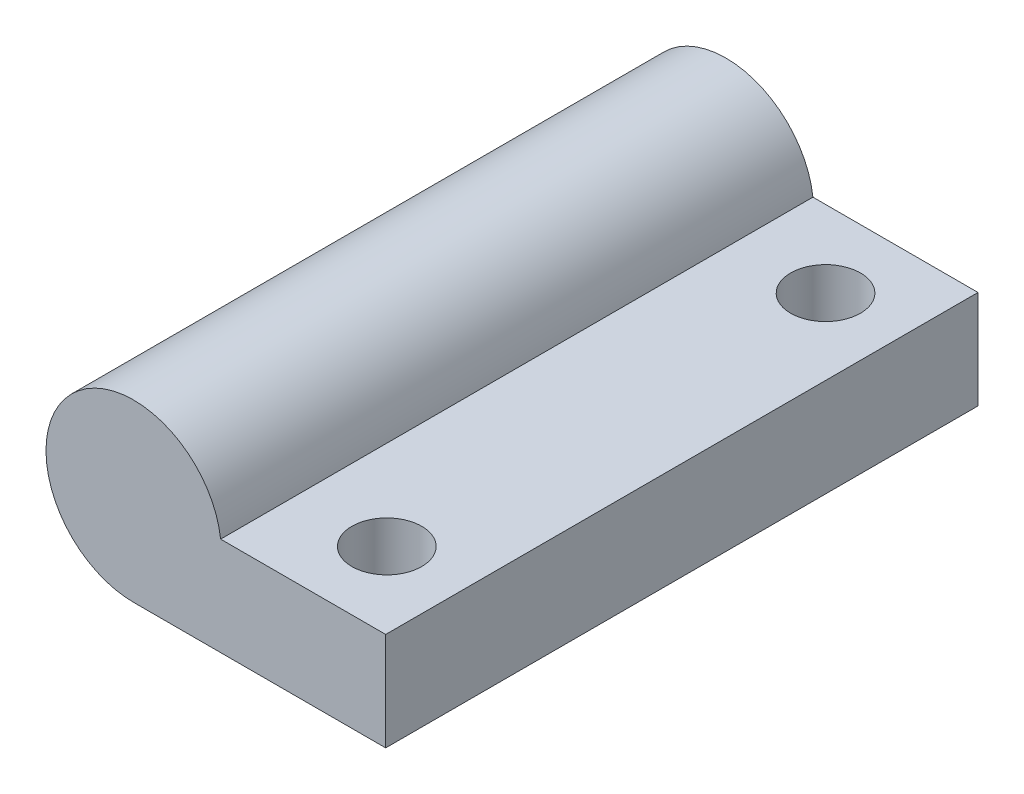
ISO-10303-21;
HEADER;
FILE_DESCRIPTION(('STEP AP214'),'2;1');
FILE_NAME('part.step','',(''),(''),'','','');
FILE_SCHEMA(('AUTOMOTIVE_DESIGN { 1 0 10303 214 1 1 1 1 }'));
ENDSEC;
DATA;
#1=APPLICATION_CONTEXT('core data for automotive mechanical design processes');
#2=APPLICATION_PROTOCOL_DEFINITION('international standard','automotive_design',2000,#1);
#3=PRODUCT_CONTEXT('',#1,'mechanical');
#4=PRODUCT('Part','Part','',(#3));
#5=PRODUCT_RELATED_PRODUCT_CATEGORY('part','',(#4));
#6=PRODUCT_DEFINITION_FORMATION('','',#4);
#7=PRODUCT_DEFINITION_CONTEXT('part definition',#1,'design');
#8=PRODUCT_DEFINITION('design','',#6,#7);
#9=PRODUCT_DEFINITION_SHAPE('','',#8);
#10=(LENGTH_UNIT() NAMED_UNIT(*) SI_UNIT(.MILLI.,.METRE.));
#11=(NAMED_UNIT(*) PLANE_ANGLE_UNIT() SI_UNIT($,.RADIAN.));
#12=(NAMED_UNIT(*) SI_UNIT($,.STERADIAN.) SOLID_ANGLE_UNIT());
#13=UNCERTAINTY_MEASURE_WITH_UNIT(LENGTH_MEASURE(1.E-05),#10,'distance_accuracy_value','');
#14=(GEOMETRIC_REPRESENTATION_CONTEXT(3) GLOBAL_UNCERTAINTY_ASSIGNED_CONTEXT((#13)) GLOBAL_UNIT_ASSIGNED_CONTEXT((#10,
#11,#12)) REPRESENTATION_CONTEXT('',''));
#15=CARTESIAN_POINT('',(0.,0.,0.));
#16=DIRECTION('',(0.,0.,1.));
#17=DIRECTION('',(1.,0.,0.));
#18=AXIS2_PLACEMENT_3D('',#15,#16,#17);
#19=CARTESIAN_POINT('',(-19.1497125132568,32.0635965828504,42.8625));
#20=DIRECTION('',(0.,0.,-1.));
#21=DIRECTION('',(-1.,0.,0.));
#22=AXIS2_PLACEMENT_3D('',#19,#20,#21);
#23=CYLINDRICAL_SURFACE('',#22,6.34209567040549);
#24=CARTESIAN_POINT('',(-19.1497125132568,32.0635965828504,0.));
#25=DIRECTION('',(0.,0.,1.));
#26=DIRECTION('',(1.,0.,0.));
#27=AXIS2_PLACEMENT_3D('',#24,#25,#26);
#28=CIRCLE('',#27,6.34209567040549);
#29=CARTESIAN_POINT('',(-12.8545605618301,32.833816941595,0.));
#30=VERTEX_POINT('',#29);
#31=CARTESIAN_POINT('',(-19.0864000000001,25.721816941595,0.));
#32=VERTEX_POINT('',#31);
#33=EDGE_CURVE('E97',#30,#32,#28,.T.);
#34=ORIENTED_EDGE('',*,*,#33,.T.);
#35=DIRECTION('',(0.,0.,-1.));
#36=VECTOR('',#35,1.);
#37=CARTESIAN_POINT('',(-19.0864000000001,25.721816941595,42.8625));
#38=LINE('',#37,#36);
#39=CARTESIAN_POINT('',(-19.0864000000001,25.721816941595,42.8625));
#40=VERTEX_POINT('',#39);
#41=EDGE_CURVE('E11',#40,#32,#38,.T.);
#42=ORIENTED_EDGE('',*,*,#41,.F.);
#43=CARTESIAN_POINT('',(-19.1497125132568,32.0635965828504,42.8625));
#44=DIRECTION('',(0.,0.,1.));
#45=DIRECTION('',(1.,0.,0.));
#46=AXIS2_PLACEMENT_3D('',#43,#44,#45);
#47=CIRCLE('',#46,6.34209567040549);
#48=CARTESIAN_POINT('',(-12.8545605618301,32.833816941595,42.8625));
#49=VERTEX_POINT('',#48);
#50=EDGE_CURVE('E84',#49,#40,#47,.T.);
#51=ORIENTED_EDGE('',*,*,#50,.F.);
#52=DIRECTION('',(0.,0.,-1.));
#53=VECTOR('',#52,1.);
#54=CARTESIAN_POINT('',(-12.8545605618301,32.833816941595,42.8625));
#55=LINE('',#54,#53);
#56=EDGE_CURVE('E93',#49,#30,#55,.T.);
#57=ORIENTED_EDGE('',*,*,#56,.T.);
#58=EDGE_LOOP('',(#34,#42,#51,#57));
#59=FACE_BOUND('',#58,.T.);
#60=ADVANCED_FACE('F31',(#59),#23,.T.);
#61=CARTESIAN_POINT('',(-19.0864000000001,25.721816941595,42.8625));
#62=DIRECTION('',(0.,1.,0.));
#63=DIRECTION('',(0.,0.,1.));
#64=AXIS2_PLACEMENT_3D('',#61,#62,#63);
#65=PLANE('',#64);
#66=CARTESIAN_POINT('',(-6.38640000000008,25.721816941595,37.30625));
#67=DIRECTION('',(0.,1.,0.));
#68=DIRECTION('',(0.,0.,1.));
#69=AXIS2_PLACEMENT_3D('',#66,#67,#68);
#70=CIRCLE('',#69,1.25911903444891);
#71=CARTESIAN_POINT('',(-6.38640000000008,25.721816941595,38.5653690344489));
#72=VERTEX_POINT('',#71);
#73=EDGE_CURVE('E34',#72,#72,#70,.T.);
#74=ORIENTED_EDGE('',*,*,#73,.T.);
#75=EDGE_LOOP('',(#74));
#76=FACE_BOUND('',#75,.T.);
#77=CARTESIAN_POINT('',(-6.38640000000008,25.721816941595,5.55625));
#78=DIRECTION('',(0.,1.,0.));
#79=DIRECTION('',(0.,0.,1.));
#80=AXIS2_PLACEMENT_3D('',#77,#78,#79);
#81=CIRCLE('',#80,1.25911903444891);
#82=CARTESIAN_POINT('',(-6.38640000000008,25.721816941595,6.81536903444891));
#83=VERTEX_POINT('',#82);
#84=EDGE_CURVE('E100',#83,#83,#81,.T.);
#85=ORIENTED_EDGE('',*,*,#84,.T.);
#86=EDGE_LOOP('',(#85));
#87=FACE_BOUND('',#86,.T.);
#88=DIRECTION('',(1.,0.,0.));
#89=VECTOR('',#88,1.);
#90=CARTESIAN_POINT('',(-19.0864000000001,25.721816941595,0.));
#91=LINE('',#90,#89);
#92=CARTESIAN_POINT('',(-0.91057903979852,25.721816941595,0.));
#93=VERTEX_POINT('',#92);
#94=EDGE_CURVE('E88',#32,#93,#91,.T.);
#95=ORIENTED_EDGE('',*,*,#94,.T.);
#96=DIRECTION('',(0.,0.,-1.));
#97=VECTOR('',#96,1.);
#98=CARTESIAN_POINT('',(-0.91057903979852,25.721816941595,42.8625));
#99=LINE('',#98,#97);
#100=CARTESIAN_POINT('',(-0.91057903979852,25.721816941595,42.8625));
#101=VERTEX_POINT('',#100);
#102=EDGE_CURVE('E40',#101,#93,#99,.T.);
#103=ORIENTED_EDGE('',*,*,#102,.F.);
#104=DIRECTION('',(1.,0.,0.));
#105=VECTOR('',#104,1.);
#106=CARTESIAN_POINT('',(-19.0864000000001,25.721816941595,42.8625));
#107=LINE('',#106,#105);
#108=EDGE_CURVE('E79',#40,#101,#107,.T.);
#109=ORIENTED_EDGE('',*,*,#108,.F.);
#110=ORIENTED_EDGE('',*,*,#41,.T.);
#111=EDGE_LOOP('',(#95,#103,#109,#110));
#112=FACE_BOUND('',#111,.T.);
#113=ADVANCED_FACE('F87',(#76,#87,#112),#65,.F.);
#114=CARTESIAN_POINT('',(-0.91057903979852,25.721816941595,42.8625));
#115=DIRECTION('',(-1.,0.,0.));
#116=DIRECTION('',(0.,0.,1.));
#117=AXIS2_PLACEMENT_3D('',#114,#115,#116);
#118=PLANE('',#117);
#119=DIRECTION('',(0.,1.,0.));
#120=VECTOR('',#119,1.);
#121=CARTESIAN_POINT('',(-0.91057903979852,25.721816941595,0.));
#122=LINE('',#121,#120);
#123=CARTESIAN_POINT('',(-0.91057903979852,32.833816941595,0.));
#124=VERTEX_POINT('',#123);
#125=EDGE_CURVE('E66',#93,#124,#122,.T.);
#126=ORIENTED_EDGE('',*,*,#125,.T.);
#127=DIRECTION('',(0.,0.,-1.));
#128=VECTOR('',#127,1.);
#129=CARTESIAN_POINT('',(-0.91057903979852,32.833816941595,42.8625));
#130=LINE('',#129,#128);
#131=CARTESIAN_POINT('',(-0.91057903979852,32.833816941595,42.8625));
#132=VERTEX_POINT('',#131);
#133=EDGE_CURVE('E89',#132,#124,#130,.T.);
#134=ORIENTED_EDGE('',*,*,#133,.F.);
#135=DIRECTION('',(0.,1.,0.));
#136=VECTOR('',#135,1.);
#137=CARTESIAN_POINT('',(-0.91057903979852,25.721816941595,42.8625));
#138=LINE('',#137,#136);
#139=EDGE_CURVE('E82',#101,#132,#138,.T.);
#140=ORIENTED_EDGE('',*,*,#139,.F.);
#141=ORIENTED_EDGE('',*,*,#102,.T.);
#142=EDGE_LOOP('',(#126,#134,#140,#141));
#143=FACE_BOUND('',#142,.T.);
#144=ADVANCED_FACE('F91',(#143),#118,.F.);
#145=CARTESIAN_POINT('',(-0.91057903979852,32.833816941595,42.8625));
#146=DIRECTION('',(0.,-1.,0.));
#147=DIRECTION('',(0.,0.,-1.));
#148=AXIS2_PLACEMENT_3D('',#145,#146,#147);
#149=PLANE('',#148);
#150=CARTESIAN_POINT('',(-6.38640000000008,32.833816941595,37.30625));
#151=DIRECTION('',(0.,1.,0.));
#152=DIRECTION('',(0.,0.,1.));
#153=AXIS2_PLACEMENT_3D('',#150,#151,#152);
#154=CIRCLE('',#153,2.5273);
#155=CARTESIAN_POINT('',(-6.38640000000008,32.833816941595,39.83355));
#156=VERTEX_POINT('',#155);
#157=EDGE_CURVE('E120',#156,#156,#154,.T.);
#158=ORIENTED_EDGE('',*,*,#157,.F.);
#159=EDGE_LOOP('',(#158));
#160=FACE_BOUND('',#159,.T.);
#161=CARTESIAN_POINT('',(-6.38640000000008,32.833816941595,5.55625));
#162=DIRECTION('',(0.,1.,0.));
#163=DIRECTION('',(0.,0.,1.));
#164=AXIS2_PLACEMENT_3D('',#161,#162,#163);
#165=CIRCLE('',#164,2.5273);
#166=CARTESIAN_POINT('',(-6.38640000000008,32.833816941595,8.08355));
#167=VERTEX_POINT('',#166);
#168=EDGE_CURVE('E110',#167,#167,#165,.T.);
#169=ORIENTED_EDGE('',*,*,#168,.F.);
#170=EDGE_LOOP('',(#169));
#171=FACE_BOUND('',#170,.T.);
#172=DIRECTION('',(-1.,0.,0.));
#173=VECTOR('',#172,1.);
#174=CARTESIAN_POINT('',(-0.91057903979852,32.833816941595,0.));
#175=LINE('',#174,#173);
#176=EDGE_CURVE('E72',#124,#30,#175,.T.);
#177=ORIENTED_EDGE('',*,*,#176,.T.);
#178=ORIENTED_EDGE('',*,*,#56,.F.);
#179=DIRECTION('',(-1.,0.,0.));
#180=VECTOR('',#179,1.);
#181=CARTESIAN_POINT('',(-0.91057903979852,32.833816941595,42.8625));
#182=LINE('',#181,#180);
#183=EDGE_CURVE('E49',#132,#49,#182,.T.);
#184=ORIENTED_EDGE('',*,*,#183,.F.);
#185=ORIENTED_EDGE('',*,*,#133,.T.);
#186=EDGE_LOOP('',(#177,#178,#184,#185));
#187=FACE_BOUND('',#186,.T.);
#188=ADVANCED_FACE('F126',(#160,#171,#187),#149,.F.);
#189=CARTESIAN_POINT('',(-19.1497125132568,32.0635965828504,42.8625));
#190=DIRECTION('',(0.,0.,1.));
#191=DIRECTION('',(1.,0.,0.));
#192=AXIS2_PLACEMENT_3D('',#189,#190,#191);
#193=PLANE('',#192);
#194=ORIENTED_EDGE('',*,*,#50,.T.);
#195=ORIENTED_EDGE('',*,*,#108,.T.);
#196=ORIENTED_EDGE('',*,*,#139,.T.);
#197=ORIENTED_EDGE('',*,*,#183,.T.);
#198=EDGE_LOOP('',(#194,#195,#196,#197));
#199=FACE_BOUND('',#198,.T.);
#200=ADVANCED_FACE('F80',(#199),#193,.T.);
#201=CARTESIAN_POINT('',(-19.1497125132568,32.0635965828504,0.));
#202=DIRECTION('',(0.,0.,1.));
#203=DIRECTION('',(1.,0.,0.));
#204=AXIS2_PLACEMENT_3D('',#201,#202,#203);
#205=PLANE('',#204);
#206=ORIENTED_EDGE('',*,*,#33,.F.);
#207=ORIENTED_EDGE('',*,*,#176,.F.);
#208=ORIENTED_EDGE('',*,*,#125,.F.);
#209=ORIENTED_EDGE('',*,*,#94,.F.);
#210=EDGE_LOOP('',(#206,#207,#208,#209));
#211=FACE_BOUND('',#210,.T.);
#212=ADVANCED_FACE('F144',(#211),#205,.F.);
#213=CARTESIAN_POINT('',(-6.38640000000008,26.483816941595,5.55625));
#214=DIRECTION('',(0.,1.,0.));
#215=DIRECTION('',(0.,0.,1.));
#216=AXIS2_PLACEMENT_3D('',#213,#214,#215);
#217=CONICAL_SURFACE('',#216,2.5273,1.02974425867665);
#218=CARTESIAN_POINT('',(-6.38640000000008,26.483816941595,5.55625));
#219=DIRECTION('',(0.,1.,0.));
#220=DIRECTION('',(0.,0.,1.));
#221=AXIS2_PLACEMENT_3D('',#218,#219,#220);
#222=CIRCLE('',#221,2.5273);
#223=CARTESIAN_POINT('',(-6.38640000000008,26.483816941595,8.08355));
#224=VERTEX_POINT('',#223);
#225=EDGE_CURVE('E106',#224,#224,#222,.T.);
#226=ORIENTED_EDGE('',*,*,#225,.T.);
#227=EDGE_LOOP('',(#226));
#228=FACE_BOUND('',#227,.T.);
#229=ORIENTED_EDGE('',*,*,#84,.F.);
#230=EDGE_LOOP('',(#229));
#231=FACE_BOUND('',#230,.T.);
#232=ADVANCED_FACE('F135',(#228,#231),#217,.F.);
#233=CARTESIAN_POINT('',(-6.38640000000008,32.833816941595,5.55625));
#234=DIRECTION('',(0.,1.,0.));
#235=DIRECTION('',(0.,0.,1.));
#236=AXIS2_PLACEMENT_3D('',#233,#234,#235);
#237=CYLINDRICAL_SURFACE('',#236,2.5273);
#238=ORIENTED_EDGE('',*,*,#225,.F.);
#239=EDGE_LOOP('',(#238));
#240=FACE_BOUND('',#239,.T.);
#241=ORIENTED_EDGE('',*,*,#168,.T.);
#242=EDGE_LOOP('',(#241));
#243=FACE_BOUND('',#242,.T.);
#244=ADVANCED_FACE('F132',(#240,#243),#237,.F.);
#245=CARTESIAN_POINT('',(-6.38640000000008,26.483816941595,37.30625));
#246=DIRECTION('',(0.,1.,0.));
#247=DIRECTION('',(0.,0.,1.));
#248=AXIS2_PLACEMENT_3D('',#245,#246,#247);
#249=CONICAL_SURFACE('',#248,2.5273,1.02974425867665);
#250=CARTESIAN_POINT('',(-6.38640000000008,26.483816941595,37.30625));
#251=DIRECTION('',(0.,1.,0.));
#252=DIRECTION('',(0.,0.,1.));
#253=AXIS2_PLACEMENT_3D('',#250,#251,#252);
#254=CIRCLE('',#253,2.5273);
#255=CARTESIAN_POINT('',(-6.38640000000008,26.483816941595,39.83355));
#256=VERTEX_POINT('',#255);
#257=EDGE_CURVE('E117',#256,#256,#254,.T.);
#258=ORIENTED_EDGE('',*,*,#257,.T.);
#259=EDGE_LOOP('',(#258));
#260=FACE_BOUND('',#259,.T.);
#261=ORIENTED_EDGE('',*,*,#73,.F.);
#262=EDGE_LOOP('',(#261));
#263=FACE_BOUND('',#262,.T.);
#264=ADVANCED_FACE('F134',(#260,#263),#249,.F.);
#265=CARTESIAN_POINT('',(-6.38640000000008,32.833816941595,37.30625));
#266=DIRECTION('',(0.,1.,0.));
#267=DIRECTION('',(0.,0.,1.));
#268=AXIS2_PLACEMENT_3D('',#265,#266,#267);
#269=CYLINDRICAL_SURFACE('',#268,2.5273);
#270=ORIENTED_EDGE('',*,*,#257,.F.);
#271=EDGE_LOOP('',(#270));
#272=FACE_BOUND('',#271,.T.);
#273=ORIENTED_EDGE('',*,*,#157,.T.);
#274=EDGE_LOOP('',(#273));
#275=FACE_BOUND('',#274,.T.);
#276=ADVANCED_FACE('F124',(#272,#275),#269,.F.);
#277=CLOSED_SHELL('',(#60,#113,#144,#188,#200,#212,#232,#244,#264,#276));
#278=MANIFOLD_SOLID_BREP('B2',#277);
#279=ADVANCED_BREP_SHAPE_REPRESENTATION('',(#18,#278),#14);
#280=SHAPE_DEFINITION_REPRESENTATION(#9,#279);
ENDSEC;
END-ISO-10303-21;
